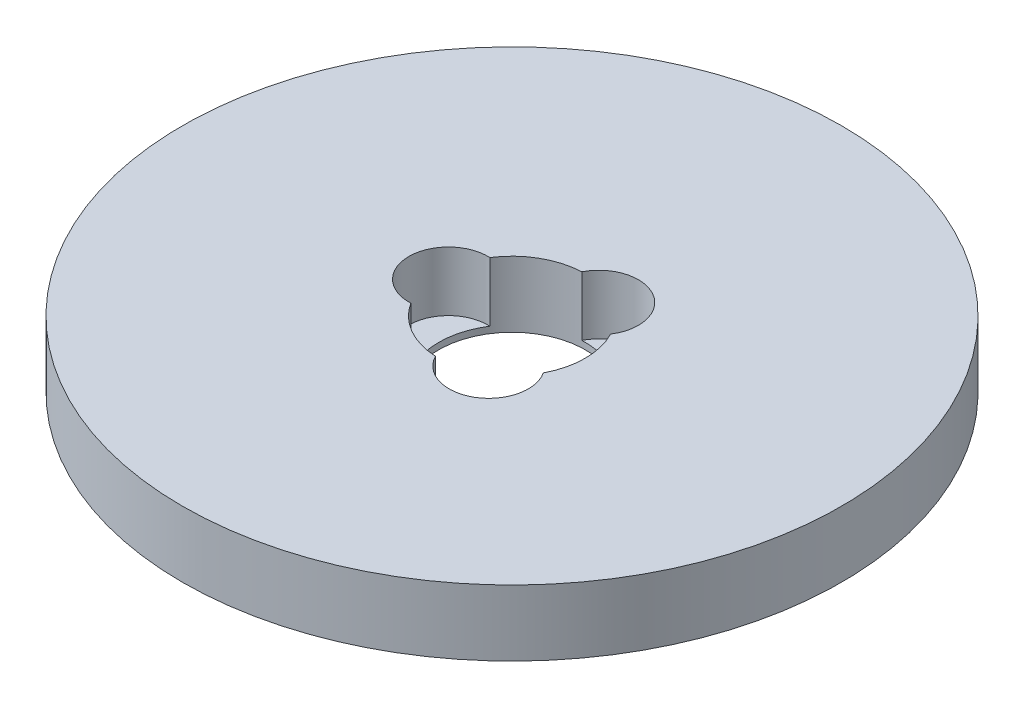
ISO-10303-21;
HEADER;
FILE_DESCRIPTION(('STEP AP214'),'2;1');
FILE_NAME('part.step','',(''),(''),'','','');
FILE_SCHEMA(('AUTOMOTIVE_DESIGN { 1 0 10303 214 1 1 1 1 }'));
ENDSEC;
DATA;
#1=APPLICATION_CONTEXT('core data for automotive mechanical design processes');
#2=APPLICATION_PROTOCOL_DEFINITION('international standard','automotive_design',2000,#1);
#3=PRODUCT_CONTEXT('',#1,'mechanical');
#4=PRODUCT('Part','Part','',(#3));
#5=PRODUCT_RELATED_PRODUCT_CATEGORY('part','',(#4));
#6=PRODUCT_DEFINITION_FORMATION('','',#4);
#7=PRODUCT_DEFINITION_CONTEXT('part definition',#1,'design');
#8=PRODUCT_DEFINITION('design','',#6,#7);
#9=PRODUCT_DEFINITION_SHAPE('','',#8);
#10=(LENGTH_UNIT() NAMED_UNIT(*) SI_UNIT(.MILLI.,.METRE.));
#11=(NAMED_UNIT(*) PLANE_ANGLE_UNIT() SI_UNIT($,.RADIAN.));
#12=(NAMED_UNIT(*) SI_UNIT($,.STERADIAN.) SOLID_ANGLE_UNIT());
#13=UNCERTAINTY_MEASURE_WITH_UNIT(LENGTH_MEASURE(1.E-05),#10,'distance_accuracy_value','');
#14=(GEOMETRIC_REPRESENTATION_CONTEXT(3) GLOBAL_UNCERTAINTY_ASSIGNED_CONTEXT((#13)) GLOBAL_UNIT_ASSIGNED_CONTEXT((#10,
#11,#12)) REPRESENTATION_CONTEXT('',''));
#15=CARTESIAN_POINT('',(0.,0.,0.));
#16=DIRECTION('',(0.,0.,1.));
#17=DIRECTION('',(1.,0.,0.));
#18=AXIS2_PLACEMENT_3D('',#15,#16,#17);
#19=CARTESIAN_POINT('',(0.,9.,0.));
#20=DIRECTION('',(0.,-1.,0.));
#21=DIRECTION('',(0.,0.,-1.));
#22=AXIS2_PLACEMENT_3D('',#19,#20,#21);
#23=CYLINDRICAL_SURFACE('',#22,45.);
#24=CARTESIAN_POINT('',(0.,9.,0.));
#25=DIRECTION('',(0.,1.,0.));
#26=DIRECTION('',(0.,0.,1.));
#27=AXIS2_PLACEMENT_3D('',#24,#25,#26);
#28=CIRCLE('',#27,45.);
#29=CARTESIAN_POINT('',(0.,9.,45.));
#30=VERTEX_POINT('',#29);
#31=EDGE_CURVE('E126',#30,#30,#28,.T.);
#32=ORIENTED_EDGE('',*,*,#31,.F.);
#33=EDGE_LOOP('',(#32));
#34=FACE_BOUND('',#33,.T.);
#35=CARTESIAN_POINT('',(0.,0.,0.));
#36=DIRECTION('',(0.,1.,0.));
#37=DIRECTION('',(0.,0.,1.));
#38=AXIS2_PLACEMENT_3D('',#35,#36,#37);
#39=CIRCLE('',#38,45.);
#40=CARTESIAN_POINT('',(0.,0.,45.));
#41=VERTEX_POINT('',#40);
#42=EDGE_CURVE('E124',#41,#41,#39,.T.);
#43=ORIENTED_EDGE('',*,*,#42,.T.);
#44=EDGE_LOOP('',(#43));
#45=FACE_BOUND('',#44,.T.);
#46=ADVANCED_FACE('F39',(#34,#45),#23,.T.);
#47=CARTESIAN_POINT('',(0.,9.,0.));
#48=DIRECTION('',(0.,1.,0.));
#49=DIRECTION('',(0.,0.,1.));
#50=AXIS2_PLACEMENT_3D('',#47,#48,#49);
#51=PLANE('',#50);
#52=CARTESIAN_POINT('',(4.3402062528246,9.,7.51745774522026));
#53=DIRECTION('',(0.,1.,0.));
#54=DIRECTION('',(0.866025403784436,0.,-0.500000000000004));
#55=AXIS2_PLACEMENT_3D('',#52,#53,#54);
#56=CIRCLE('',#55,5.39995044486627);
#57=CARTESIAN_POINT('',(-0.460737738260733,9.,9.98938039802982));
#58=VERTEX_POINT('',#57);
#59=CARTESIAN_POINT('',(8.88142606189054,9.,4.59567961319885));
#60=VERTEX_POINT('',#59);
#61=EDGE_CURVE('E147',#58,#60,#56,.T.);
#62=ORIENTED_EDGE('',*,*,#61,.F.);
#63=CARTESIAN_POINT('',(0.,9.,0.));
#64=DIRECTION('',(0.,1.,0.));
#65=DIRECTION('',(0.,0.,1.));
#66=AXIS2_PLACEMENT_3D('',#63,#64,#65);
#67=CIRCLE('',#66,10.);
#68=CARTESIAN_POINT('',(-8.42068832362974,9.,5.39370078483093));
#69=VERTEX_POINT('',#68);
#70=EDGE_CURVE('E118',#69,#58,#67,.T.);
#71=ORIENTED_EDGE('',*,*,#70,.F.);
#72=CARTESIAN_POINT('',(-8.68041250564913,9.,0.));
#73=DIRECTION('',(0.,1.,0.));
#74=DIRECTION('',(0.,0.,1.));
#75=AXIS2_PLACEMENT_3D('',#72,#73,#74);
#76=CIRCLE('',#75,5.39995044486627);
#77=CARTESIAN_POINT('',(-8.42068832362974,9.,-5.39370078483093));
#78=VERTEX_POINT('',#77);
#79=EDGE_CURVE('E113',#78,#69,#76,.T.);
#80=ORIENTED_EDGE('',*,*,#79,.F.);
#81=CARTESIAN_POINT('',(-0.460737738260873,9.,-9.98938039802981));
#82=VERTEX_POINT('',#81);
#83=EDGE_CURVE('E106',#82,#78,#67,.T.);
#84=ORIENTED_EDGE('',*,*,#83,.F.);
#85=CARTESIAN_POINT('',(4.3402062528245,9.,-7.51745774522032));
#86=DIRECTION('',(0.,1.,0.));
#87=DIRECTION('',(-0.866025403784443,0.,-0.499999999999992));
#88=AXIS2_PLACEMENT_3D('',#85,#86,#87);
#89=CIRCLE('',#88,5.39995044486627);
#90=CARTESIAN_POINT('',(8.88142606189048,9.,-4.59567961319897));
#91=VERTEX_POINT('',#90);
#92=EDGE_CURVE('E90',#91,#82,#89,.T.);
#93=ORIENTED_EDGE('',*,*,#92,.F.);
#94=EDGE_CURVE('E116',#60,#91,#67,.T.);
#95=ORIENTED_EDGE('',*,*,#94,.F.);
#96=EDGE_LOOP('',(#62,#71,#80,#84,#93,#95));
#97=FACE_BOUND('',#96,.T.);
#98=ORIENTED_EDGE('',*,*,#31,.T.);
#99=EDGE_LOOP('',(#98));
#100=FACE_BOUND('',#99,.T.);
#101=ADVANCED_FACE('F115',(#97,#100),#51,.T.);
#102=CARTESIAN_POINT('',(0.,0.,0.));
#103=DIRECTION('',(0.,1.,0.));
#104=DIRECTION('',(0.,0.,1.));
#105=AXIS2_PLACEMENT_3D('',#102,#103,#104);
#106=PLANE('',#105);
#107=CARTESIAN_POINT('',(0.,0.,0.));
#108=DIRECTION('',(0.,1.,0.));
#109=DIRECTION('',(0.,0.,1.));
#110=AXIS2_PLACEMENT_3D('',#107,#108,#109);
#111=CIRCLE('',#110,10.);
#112=CARTESIAN_POINT('',(0.,0.,10.));
#113=VERTEX_POINT('',#112);
#114=EDGE_CURVE('E120',#113,#113,#111,.T.);
#115=ORIENTED_EDGE('',*,*,#114,.T.);
#116=EDGE_LOOP('',(#115));
#117=FACE_BOUND('',#116,.T.);
#118=ORIENTED_EDGE('',*,*,#42,.F.);
#119=EDGE_LOOP('',(#118));
#120=FACE_BOUND('',#119,.T.);
#121=ADVANCED_FACE('F164',(#117,#120),#106,.F.);
#122=CARTESIAN_POINT('',(0.,9.,0.));
#123=DIRECTION('',(0.,-1.,0.));
#124=DIRECTION('',(0.,0.,-1.));
#125=AXIS2_PLACEMENT_3D('',#122,#123,#124);
#126=CYLINDRICAL_SURFACE('',#125,10.);
#127=DIRECTION('',(0.,1.,0.));
#128=VECTOR('',#127,1.);
#129=CARTESIAN_POINT('',(-0.460737738260732,4.94179424771718,9.98938039802982));
#130=LINE('',#129,#128);
#131=CARTESIAN_POINT('',(-0.460737738260733,0.883588495434351,9.98938039802982));
#132=VERTEX_POINT('',#131);
#133=EDGE_CURVE('E11',#132,#58,#130,.T.);
#134=ORIENTED_EDGE('',*,*,#133,.F.);
#135=CARTESIAN_POINT('',(0.,0.883588495434351,0.));
#136=DIRECTION('',(0.,1.,0.));
#137=DIRECTION('',(0.,0.,1.));
#138=AXIS2_PLACEMENT_3D('',#135,#136,#137);
#139=CIRCLE('',#138,10.);
#140=CARTESIAN_POINT('',(8.88142606189054,0.883588495434351,4.59567961319885));
#141=VERTEX_POINT('',#140);
#142=EDGE_CURVE('E144',#132,#141,#139,.T.);
#143=ORIENTED_EDGE('',*,*,#142,.T.);
#144=DIRECTION('',(0.,1.,0.));
#145=VECTOR('',#144,1.);
#146=CARTESIAN_POINT('',(8.88142606189054,4.94179424771718,4.59567961319885));
#147=LINE('',#146,#145);
#148=EDGE_CURVE('E46',#60,#141,#147,.F.);
#149=ORIENTED_EDGE('',*,*,#148,.F.);
#150=ORIENTED_EDGE('',*,*,#94,.T.);
#151=DIRECTION('',(0.,1.,0.));
#152=VECTOR('',#151,1.);
#153=CARTESIAN_POINT('',(8.88142606189048,4.94179424771718,-4.59567961319897));
#154=LINE('',#153,#152);
#155=CARTESIAN_POINT('',(8.88142606189048,0.883588495434351,-4.59567961319897));
#156=VERTEX_POINT('',#155);
#157=EDGE_CURVE('E92',#156,#91,#154,.T.);
#158=ORIENTED_EDGE('',*,*,#157,.F.);
#159=CARTESIAN_POINT('',(0.,0.883588495434351,0.));
#160=DIRECTION('',(0.,1.,0.));
#161=DIRECTION('',(0.,0.,1.));
#162=AXIS2_PLACEMENT_3D('',#159,#160,#161);
#163=CIRCLE('',#162,10.);
#164=CARTESIAN_POINT('',(-0.460737738260873,0.883588495434351,-9.98938039802981));
#165=VERTEX_POINT('',#164);
#166=EDGE_CURVE('E107',#156,#165,#163,.T.);
#167=ORIENTED_EDGE('',*,*,#166,.T.);
#168=DIRECTION('',(0.,1.,0.));
#169=VECTOR('',#168,1.);
#170=CARTESIAN_POINT('',(-0.460737738260872,4.94179424771718,-9.98938039802981));
#171=LINE('',#170,#169);
#172=EDGE_CURVE('E95',#82,#165,#171,.F.);
#173=ORIENTED_EDGE('',*,*,#172,.F.);
#174=ORIENTED_EDGE('',*,*,#83,.T.);
#175=DIRECTION('',(0.,1.,0.));
#176=VECTOR('',#175,1.);
#177=CARTESIAN_POINT('',(-8.42068832362974,4.94179424771718,-5.39370078483093));
#178=LINE('',#177,#176);
#179=CARTESIAN_POINT('',(-8.42068832362974,0.883588495434351,-5.39370078483093));
#180=VERTEX_POINT('',#179);
#181=EDGE_CURVE('E143',#180,#78,#178,.T.);
#182=ORIENTED_EDGE('',*,*,#181,.F.);
#183=CARTESIAN_POINT('',(0.,0.883588495434351,0.));
#184=DIRECTION('',(0.,1.,0.));
#185=DIRECTION('',(0.,0.,1.));
#186=AXIS2_PLACEMENT_3D('',#183,#184,#185);
#187=CIRCLE('',#186,10.);
#188=CARTESIAN_POINT('',(-8.42068832362974,0.883588495434351,5.39370078483093));
#189=VERTEX_POINT('',#188);
#190=EDGE_CURVE('E132',#180,#189,#187,.T.);
#191=ORIENTED_EDGE('',*,*,#190,.T.);
#192=DIRECTION('',(0.,1.,0.));
#193=VECTOR('',#192,1.);
#194=CARTESIAN_POINT('',(-8.42068832362974,4.94179424771718,5.39370078483093));
#195=LINE('',#194,#193);
#196=EDGE_CURVE('E137',#69,#189,#195,.F.);
#197=ORIENTED_EDGE('',*,*,#196,.F.);
#198=ORIENTED_EDGE('',*,*,#70,.T.);
#199=EDGE_LOOP('',(#134,#143,#149,#150,#158,#167,#173,#174,#182,#191,#197,#198));
#200=FACE_BOUND('',#199,.T.);
#201=ORIENTED_EDGE('',*,*,#114,.F.);
#202=EDGE_LOOP('',(#201));
#203=FACE_BOUND('',#202,.T.);
#204=ADVANCED_FACE('F103',(#200,#203),#126,.F.);
#205=CARTESIAN_POINT('',(-8.68041250564913,0.883588495434351,0.));
#206=DIRECTION('',(0.,1.,0.));
#207=DIRECTION('',(0.,0.,1.));
#208=AXIS2_PLACEMENT_3D('',#205,#206,#207);
#209=CYLINDRICAL_SURFACE('',#208,5.39995044486627);
#210=ORIENTED_EDGE('',*,*,#181,.T.);
#211=ORIENTED_EDGE('',*,*,#79,.T.);
#212=ORIENTED_EDGE('',*,*,#196,.T.);
#213=CARTESIAN_POINT('',(-8.68041250564913,0.883588495434351,0.));
#214=DIRECTION('',(0.,1.,0.));
#215=DIRECTION('',(0.,0.,1.));
#216=AXIS2_PLACEMENT_3D('',#213,#214,#215);
#217=CIRCLE('',#216,5.39995044486627);
#218=EDGE_CURVE('E121',#180,#189,#217,.T.);
#219=ORIENTED_EDGE('',*,*,#218,.F.);
#220=EDGE_LOOP('',(#210,#211,#212,#219));
#221=FACE_BOUND('',#220,.T.);
#222=ADVANCED_FACE('F174',(#221),#209,.F.);
#223=CARTESIAN_POINT('',(-8.68041250564913,0.883588495434351,0.));
#224=DIRECTION('',(0.,1.,0.));
#225=DIRECTION('',(0.,0.,1.));
#226=AXIS2_PLACEMENT_3D('',#223,#224,#225);
#227=PLANE('',#226);
#228=ORIENTED_EDGE('',*,*,#218,.T.);
#229=ORIENTED_EDGE('',*,*,#190,.F.);
#230=EDGE_LOOP('',(#228,#229));
#231=FACE_BOUND('',#230,.T.);
#232=ADVANCED_FACE('F177',(#231),#227,.T.);
#233=CARTESIAN_POINT('',(4.3402062528245,0.883588495434351,-7.51745774522032));
#234=DIRECTION('',(0.,1.,0.));
#235=DIRECTION('',(0.,0.,1.));
#236=AXIS2_PLACEMENT_3D('',#233,#234,#235);
#237=CYLINDRICAL_SURFACE('',#236,5.39995044486627);
#238=ORIENTED_EDGE('',*,*,#157,.T.);
#239=ORIENTED_EDGE('',*,*,#92,.T.);
#240=ORIENTED_EDGE('',*,*,#172,.T.);
#241=CARTESIAN_POINT('',(4.3402062528245,0.883588495434351,-7.51745774522032));
#242=DIRECTION('',(0.,1.,0.));
#243=DIRECTION('',(-0.866025403784443,0.,-0.499999999999992));
#244=AXIS2_PLACEMENT_3D('',#241,#242,#243);
#245=CIRCLE('',#244,5.39995044486627);
#246=EDGE_CURVE('E56',#156,#165,#245,.T.);
#247=ORIENTED_EDGE('',*,*,#246,.F.);
#248=EDGE_LOOP('',(#238,#239,#240,#247));
#249=FACE_BOUND('',#248,.T.);
#250=ADVANCED_FACE('F93',(#249),#237,.F.);
#251=CARTESIAN_POINT('',(4.3402062528245,0.883588495434351,-7.51745774522032));
#252=DIRECTION('',(0.,1.,0.));
#253=DIRECTION('',(-0.866025403784443,0.,-0.499999999999992));
#254=AXIS2_PLACEMENT_3D('',#251,#252,#253);
#255=PLANE('',#254);
#256=ORIENTED_EDGE('',*,*,#246,.T.);
#257=ORIENTED_EDGE('',*,*,#166,.F.);
#258=EDGE_LOOP('',(#256,#257));
#259=FACE_BOUND('',#258,.T.);
#260=ADVANCED_FACE('F160',(#259),#255,.T.);
#261=CARTESIAN_POINT('',(4.3402062528246,0.883588495434351,7.51745774522026));
#262=DIRECTION('',(0.,1.,0.));
#263=DIRECTION('',(0.,0.,1.));
#264=AXIS2_PLACEMENT_3D('',#261,#262,#263);
#265=CYLINDRICAL_SURFACE('',#264,5.39995044486627);
#266=ORIENTED_EDGE('',*,*,#133,.T.);
#267=ORIENTED_EDGE('',*,*,#61,.T.);
#268=ORIENTED_EDGE('',*,*,#148,.T.);
#269=CARTESIAN_POINT('',(4.3402062528246,0.883588495434351,7.51745774522026));
#270=DIRECTION('',(0.,1.,0.));
#271=DIRECTION('',(0.866025403784436,0.,-0.500000000000004));
#272=AXIS2_PLACEMENT_3D('',#269,#270,#271);
#273=CIRCLE('',#272,5.39995044486627);
#274=EDGE_CURVE('E55',#132,#141,#273,.T.);
#275=ORIENTED_EDGE('',*,*,#274,.F.);
#276=EDGE_LOOP('',(#266,#267,#268,#275));
#277=FACE_BOUND('',#276,.T.);
#278=ADVANCED_FACE('F149',(#277),#265,.F.);
#279=CARTESIAN_POINT('',(4.3402062528246,0.883588495434351,7.51745774522026));
#280=DIRECTION('',(0.,1.,0.));
#281=DIRECTION('',(0.866025403784436,0.,-0.500000000000004));
#282=AXIS2_PLACEMENT_3D('',#279,#280,#281);
#283=PLANE('',#282);
#284=ORIENTED_EDGE('',*,*,#274,.T.);
#285=ORIENTED_EDGE('',*,*,#142,.F.);
#286=EDGE_LOOP('',(#284,#285));
#287=FACE_BOUND('',#286,.T.);
#288=ADVANCED_FACE('F151',(#287),#283,.T.);
#289=CLOSED_SHELL('',(#46,#101,#121,#204,#222,#232,#250,#260,#278,#288));
#290=MANIFOLD_SOLID_BREP('B2',#289);
#291=ADVANCED_BREP_SHAPE_REPRESENTATION('',(#18,#290),#14);
#292=SHAPE_DEFINITION_REPRESENTATION(#9,#291);
ENDSEC;
END-ISO-10303-21;
